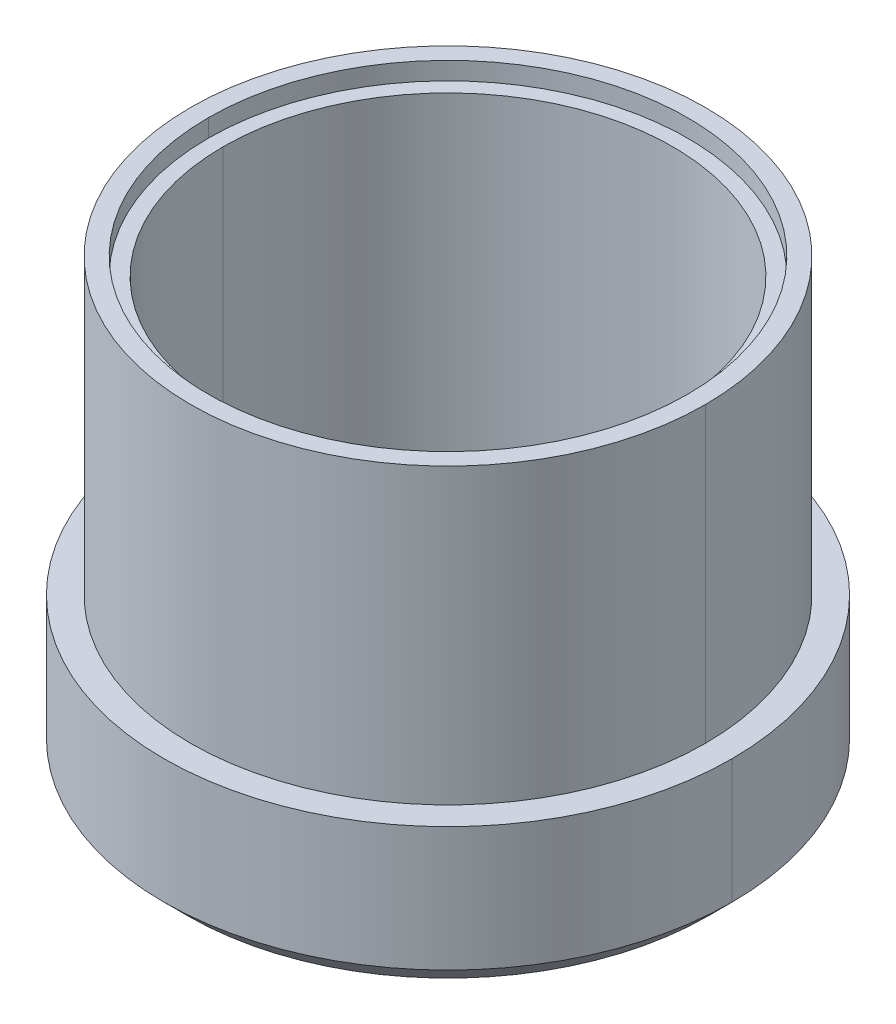
ISO-10303-21;
HEADER;
FILE_DESCRIPTION(('STEP AP214'),'2;1');
FILE_NAME('part.step','',(''),(''),'','','');
FILE_SCHEMA(('AUTOMOTIVE_DESIGN { 1 0 10303 214 1 1 1 1 }'));
ENDSEC;
DATA;
#1=APPLICATION_CONTEXT('core data for automotive mechanical design processes');
#2=APPLICATION_PROTOCOL_DEFINITION('international standard','automotive_design',2000,#1);
#3=PRODUCT_CONTEXT('',#1,'mechanical');
#4=PRODUCT('Part','Part','',(#3));
#5=PRODUCT_RELATED_PRODUCT_CATEGORY('part','',(#4));
#6=PRODUCT_DEFINITION_FORMATION('','',#4);
#7=PRODUCT_DEFINITION_CONTEXT('part definition',#1,'design');
#8=PRODUCT_DEFINITION('design','',#6,#7);
#9=PRODUCT_DEFINITION_SHAPE('','',#8);
#10=(LENGTH_UNIT() NAMED_UNIT(*) SI_UNIT(.MILLI.,.METRE.));
#11=(NAMED_UNIT(*) PLANE_ANGLE_UNIT() SI_UNIT($,.RADIAN.));
#12=(NAMED_UNIT(*) SI_UNIT($,.STERADIAN.) SOLID_ANGLE_UNIT());
#13=UNCERTAINTY_MEASURE_WITH_UNIT(LENGTH_MEASURE(1.E-05),#10,'distance_accuracy_value','');
#14=(GEOMETRIC_REPRESENTATION_CONTEXT(3) GLOBAL_UNCERTAINTY_ASSIGNED_CONTEXT((#13)) GLOBAL_UNIT_ASSIGNED_CONTEXT((#10,
#11,#12)) REPRESENTATION_CONTEXT('',''));
#15=CARTESIAN_POINT('',(0.,0.,0.));
#16=DIRECTION('',(0.,0.,1.));
#17=DIRECTION('',(1.,0.,0.));
#18=AXIS2_PLACEMENT_3D('',#15,#16,#17);
#19=CARTESIAN_POINT('',(0.,0.,0.));
#20=DIRECTION('',(0.,1.,0.));
#21=DIRECTION('',(0.,0.,1.));
#22=AXIS2_PLACEMENT_3D('',#19,#20,#21);
#23=CYLINDRICAL_SURFACE('',#22,5.5245);
#24=DIRECTION('',(0.,1.,0.));
#25=VECTOR('',#24,1.);
#26=CARTESIAN_POINT('',(-5.5245,0.,0.));
#27=LINE('',#26,#25);
#28=CARTESIAN_POINT('',(-5.5245,3.175,0.));
#29=VERTEX_POINT('',#28);
#30=CARTESIAN_POINT('',(-5.5245,9.4742,0.));
#31=VERTEX_POINT('',#30);
#32=EDGE_CURVE('E93',#29,#31,#27,.T.);
#33=ORIENTED_EDGE('',*,*,#32,.F.);
#34=CARTESIAN_POINT('',(0.,3.175,0.));
#35=DIRECTION('',(0.,1.,0.));
#36=DIRECTION('',(0.,0.,1.));
#37=AXIS2_PLACEMENT_3D('',#34,#35,#36);
#38=CIRCLE('',#37,5.5245);
#39=CARTESIAN_POINT('',(5.5245,3.175,0.));
#40=VERTEX_POINT('',#39);
#41=EDGE_CURVE('E19',#40,#29,#38,.F.);
#42=ORIENTED_EDGE('',*,*,#41,.F.);
#43=DIRECTION('',(0.,1.,0.));
#44=VECTOR('',#43,1.);
#45=CARTESIAN_POINT('',(5.5245,0.,0.));
#46=LINE('',#45,#44);
#47=CARTESIAN_POINT('',(5.5245,9.4742,0.));
#48=VERTEX_POINT('',#47);
#49=EDGE_CURVE('E82',#48,#40,#46,.F.);
#50=ORIENTED_EDGE('',*,*,#49,.F.);
#51=CARTESIAN_POINT('',(0.,9.4742,0.));
#52=DIRECTION('',(0.,1.,0.));
#53=DIRECTION('',(0.,0.,1.));
#54=AXIS2_PLACEMENT_3D('',#51,#52,#53);
#55=CIRCLE('',#54,5.5245);
#56=EDGE_CURVE('E94',#31,#48,#55,.T.);
#57=ORIENTED_EDGE('',*,*,#56,.F.);
#58=EDGE_LOOP('',(#33,#42,#50,#57));
#59=FACE_BOUND('',#58,.T.);
#60=ADVANCED_FACE('F16',(#59),#23,.T.);
#61=CARTESIAN_POINT('',(0.,0.,0.));
#62=DIRECTION('',(0.,1.,0.));
#63=DIRECTION('',(0.,0.,1.));
#64=AXIS2_PLACEMENT_3D('',#61,#62,#63);
#65=CYLINDRICAL_SURFACE('',#64,5.5245);
#66=ORIENTED_EDGE('',*,*,#49,.T.);
#67=CARTESIAN_POINT('',(0.,3.175,0.));
#68=DIRECTION('',(0.,1.,0.));
#69=DIRECTION('',(0.,0.,1.));
#70=AXIS2_PLACEMENT_3D('',#67,#68,#69);
#71=CIRCLE('',#70,5.5245);
#72=EDGE_CURVE('E90',#29,#40,#71,.F.);
#73=ORIENTED_EDGE('',*,*,#72,.F.);
#74=ORIENTED_EDGE('',*,*,#32,.T.);
#75=CARTESIAN_POINT('',(0.,9.4742,0.));
#76=DIRECTION('',(0.,1.,0.));
#77=DIRECTION('',(0.,0.,1.));
#78=AXIS2_PLACEMENT_3D('',#75,#76,#77);
#79=CIRCLE('',#78,5.5245);
#80=EDGE_CURVE('E98',#48,#31,#79,.T.);
#81=ORIENTED_EDGE('',*,*,#80,.F.);
#82=EDGE_LOOP('',(#66,#73,#74,#81));
#83=FACE_BOUND('',#82,.T.);
#84=ADVANCED_FACE('F97',(#83),#65,.T.);
#85=CARTESIAN_POINT('',(0.,3.175,0.));
#86=DIRECTION('',(0.,1.,0.));
#87=DIRECTION('',(0.,0.,1.));
#88=AXIS2_PLACEMENT_3D('',#85,#86,#87);
#89=PLANE('',#88);
#90=ORIENTED_EDGE('',*,*,#41,.T.);
#91=ORIENTED_EDGE('',*,*,#72,.T.);
#92=EDGE_LOOP('',(#90,#91));
#93=FACE_BOUND('',#92,.T.);
#94=CARTESIAN_POINT('',(0.,3.175,0.));
#95=DIRECTION('',(0.,1.,0.));
#96=DIRECTION('',(0.,0.,1.));
#97=AXIS2_PLACEMENT_3D('',#94,#95,#96);
#98=CIRCLE('',#97,6.096);
#99=CARTESIAN_POINT('',(6.096,3.175,0.));
#100=VERTEX_POINT('',#99);
#101=CARTESIAN_POINT('',(-6.096,3.175,0.));
#102=VERTEX_POINT('',#101);
#103=EDGE_CURVE('E105',#100,#102,#98,.F.);
#104=ORIENTED_EDGE('',*,*,#103,.F.);
#105=CARTESIAN_POINT('',(0.,3.175,0.));
#106=DIRECTION('',(0.,1.,0.));
#107=DIRECTION('',(0.,0.,1.));
#108=AXIS2_PLACEMENT_3D('',#105,#106,#107);
#109=CIRCLE('',#108,6.096);
#110=EDGE_CURVE('E102',#102,#100,#109,.F.);
#111=ORIENTED_EDGE('',*,*,#110,.F.);
#112=EDGE_LOOP('',(#104,#111));
#113=FACE_BOUND('',#112,.T.);
#114=ADVANCED_FACE('F88',(#93,#113),#89,.T.);
#115=CARTESIAN_POINT('',(0.,9.4742,0.));
#116=DIRECTION('',(0.,1.,0.));
#117=DIRECTION('',(0.,0.,1.));
#118=AXIS2_PLACEMENT_3D('',#115,#116,#117);
#119=PLANE('',#118);
#120=CARTESIAN_POINT('',(0.,9.4742,0.));
#121=DIRECTION('',(0.,1.,0.));
#122=DIRECTION('',(0.,0.,1.));
#123=AXIS2_PLACEMENT_3D('',#120,#121,#122);
#124=CIRCLE('',#123,5.1435);
#125=CARTESIAN_POINT('',(5.1435,9.4742,0.));
#126=VERTEX_POINT('',#125);
#127=CARTESIAN_POINT('',(-5.1435,9.4742,0.));
#128=VERTEX_POINT('',#127);
#129=EDGE_CURVE('E108',#126,#128,#124,.F.);
#130=ORIENTED_EDGE('',*,*,#129,.T.);
#131=CARTESIAN_POINT('',(0.,9.4742,0.));
#132=DIRECTION('',(0.,1.,0.));
#133=DIRECTION('',(0.,0.,1.));
#134=AXIS2_PLACEMENT_3D('',#131,#132,#133);
#135=CIRCLE('',#134,5.1435);
#136=EDGE_CURVE('E111',#128,#126,#135,.F.);
#137=ORIENTED_EDGE('',*,*,#136,.T.);
#138=EDGE_LOOP('',(#130,#137));
#139=FACE_BOUND('',#138,.T.);
#140=ORIENTED_EDGE('',*,*,#56,.T.);
#141=ORIENTED_EDGE('',*,*,#80,.T.);
#142=EDGE_LOOP('',(#140,#141));
#143=FACE_BOUND('',#142,.T.);
#144=ADVANCED_FACE('F188',(#139,#143),#119,.T.);
#145=CARTESIAN_POINT('',(0.,0.,0.));
#146=DIRECTION('',(0.,1.,0.));
#147=DIRECTION('',(0.,0.,1.));
#148=AXIS2_PLACEMENT_3D('',#145,#146,#147);
#149=CYLINDRICAL_SURFACE('',#148,6.096);
#150=DIRECTION('',(0.,1.,0.));
#151=VECTOR('',#150,1.);
#152=CARTESIAN_POINT('',(6.096,0.,0.));
#153=LINE('',#152,#151);
#154=CARTESIAN_POINT('',(6.09599999999602,0.508000000003506,0.));
#155=VERTEX_POINT('',#154);
#156=EDGE_CURVE('E104',#155,#100,#153,.T.);
#157=ORIENTED_EDGE('',*,*,#156,.F.);
#158=CARTESIAN_POINT('',(0.,0.508000000024822,0.));
#159=DIRECTION('',(0.,1.,0.));
#160=DIRECTION('',(1.,0.,0.));
#161=AXIS2_PLACEMENT_3D('',#158,#159,#160);
#162=CIRCLE('',#161,6.09600000001365);
#163=CARTESIAN_POINT('',(-6.09599999999602,0.508000000004405,0.));
#164=VERTEX_POINT('',#163);
#165=EDGE_CURVE('E146',#164,#155,#162,.F.);
#166=ORIENTED_EDGE('',*,*,#165,.F.);
#167=DIRECTION('',(0.,1.,0.));
#168=VECTOR('',#167,1.);
#169=CARTESIAN_POINT('',(-6.096,0.,0.));
#170=LINE('',#169,#168);
#171=EDGE_CURVE('E107',#102,#164,#170,.F.);
#172=ORIENTED_EDGE('',*,*,#171,.F.);
#173=ORIENTED_EDGE('',*,*,#110,.T.);
#174=EDGE_LOOP('',(#157,#166,#172,#173));
#175=FACE_BOUND('',#174,.T.);
#176=ADVANCED_FACE('F186',(#175),#149,.T.);
#177=CARTESIAN_POINT('',(0.,0.,0.));
#178=DIRECTION('',(0.,1.,0.));
#179=DIRECTION('',(0.,0.,1.));
#180=AXIS2_PLACEMENT_3D('',#177,#178,#179);
#181=CYLINDRICAL_SURFACE('',#180,6.096);
#182=ORIENTED_EDGE('',*,*,#171,.T.);
#183=CARTESIAN_POINT('',(0.,0.508000000024822,0.));
#184=DIRECTION('',(0.,1.,0.));
#185=DIRECTION('',(1.,0.,0.));
#186=AXIS2_PLACEMENT_3D('',#183,#184,#185);
#187=CIRCLE('',#186,6.09600000001365);
#188=EDGE_CURVE('E142',#155,#164,#187,.F.);
#189=ORIENTED_EDGE('',*,*,#188,.F.);
#190=ORIENTED_EDGE('',*,*,#156,.T.);
#191=ORIENTED_EDGE('',*,*,#103,.T.);
#192=EDGE_LOOP('',(#182,#189,#190,#191));
#193=FACE_BOUND('',#192,.T.);
#194=ADVANCED_FACE('F182',(#193),#181,.T.);
#195=CARTESIAN_POINT('',(0.,9.4742,0.));
#196=DIRECTION('',(0.,1.,0.));
#197=DIRECTION('',(0.,0.,1.));
#198=AXIS2_PLACEMENT_3D('',#195,#196,#197);
#199=CYLINDRICAL_SURFACE('',#198,5.1435);
#200=CARTESIAN_POINT('',(0.,9.0932,0.));
#201=DIRECTION('',(0.,1.,0.));
#202=DIRECTION('',(0.,0.,1.));
#203=AXIS2_PLACEMENT_3D('',#200,#201,#202);
#204=CIRCLE('',#203,5.1435);
#205=CARTESIAN_POINT('',(-5.1435,9.0932,0.));
#206=VERTEX_POINT('',#205);
#207=CARTESIAN_POINT('',(5.1435,9.0932,0.));
#208=VERTEX_POINT('',#207);
#209=EDGE_CURVE('E115',#206,#208,#204,.T.);
#210=ORIENTED_EDGE('',*,*,#209,.F.);
#211=DIRECTION('',(0.,1.,0.));
#212=VECTOR('',#211,1.);
#213=CARTESIAN_POINT('',(-5.1435,9.4742,0.));
#214=LINE('',#213,#212);
#215=EDGE_CURVE('E149',#206,#128,#214,.T.);
#216=ORIENTED_EDGE('',*,*,#215,.T.);
#217=ORIENTED_EDGE('',*,*,#129,.F.);
#218=DIRECTION('',(0.,1.,0.));
#219=VECTOR('',#218,1.);
#220=CARTESIAN_POINT('',(5.1435,9.4742,0.));
#221=LINE('',#220,#219);
#222=EDGE_CURVE('E114',#126,#208,#221,.F.);
#223=ORIENTED_EDGE('',*,*,#222,.T.);
#224=EDGE_LOOP('',(#210,#216,#217,#223));
#225=FACE_BOUND('',#224,.T.);
#226=ADVANCED_FACE('F213',(#225),#199,.F.);
#227=CARTESIAN_POINT('',(0.,9.4742,0.));
#228=DIRECTION('',(0.,1.,0.));
#229=DIRECTION('',(0.,0.,1.));
#230=AXIS2_PLACEMENT_3D('',#227,#228,#229);
#231=CYLINDRICAL_SURFACE('',#230,5.1435);
#232=CARTESIAN_POINT('',(0.,9.0932,0.));
#233=DIRECTION('',(0.,1.,0.));
#234=DIRECTION('',(0.,0.,1.));
#235=AXIS2_PLACEMENT_3D('',#232,#233,#234);
#236=CIRCLE('',#235,5.1435);
#237=EDGE_CURVE('E117',#208,#206,#236,.T.);
#238=ORIENTED_EDGE('',*,*,#237,.F.);
#239=ORIENTED_EDGE('',*,*,#222,.F.);
#240=ORIENTED_EDGE('',*,*,#136,.F.);
#241=ORIENTED_EDGE('',*,*,#215,.F.);
#242=EDGE_LOOP('',(#238,#239,#240,#241));
#243=FACE_BOUND('',#242,.T.);
#244=ADVANCED_FACE('F210',(#243),#231,.F.);
#245=CARTESIAN_POINT('',(0.,0.507999999967979,0.));
#246=DIRECTION('',(0.,1.,0.));
#247=DIRECTION('',(0.,0.,1.));
#248=AXIS2_PLACEMENT_3D('',#245,#246,#247);
#249=CONICAL_SURFACE('',#248,6.0959999999568,0.785398163397448);
#250=DIRECTION('',(-0.707106781186443,-0.707106781186652,0.));
#251=VECTOR('',#250,1.);
#252=CARTESIAN_POINT('',(499000.,498994.412000148,0.));
#253=LINE('',#252,#251);
#254=CARTESIAN_POINT('',(5.58799999998882,0.,0.));
#255=VERTEX_POINT('',#254);
#256=EDGE_CURVE('E145',#255,#155,#253,.F.);
#257=ORIENTED_EDGE('',*,*,#256,.F.);
#258=CARTESIAN_POINT('',(0.,0.,0.));
#259=DIRECTION('',(0.,1.,0.));
#260=DIRECTION('',(0.,0.,1.));
#261=AXIS2_PLACEMENT_3D('',#258,#259,#260);
#262=CIRCLE('',#261,5.58799999998882);
#263=CARTESIAN_POINT('',(-5.58799999998882,0.,0.));
#264=VERTEX_POINT('',#263);
#265=EDGE_CURVE('E121',#255,#264,#262,.T.);
#266=ORIENTED_EDGE('',*,*,#265,.T.);
#267=DIRECTION('',(0.707106781186443,-0.707106781186652,0.));
#268=VECTOR('',#267,1.);
#269=CARTESIAN_POINT('',(-499000.,498994.412000148,-6.11098752774529E-11));
#270=LINE('',#269,#268);
#271=EDGE_CURVE('E118',#164,#264,#270,.T.);
#272=ORIENTED_EDGE('',*,*,#271,.F.);
#273=ORIENTED_EDGE('',*,*,#165,.T.);
#274=EDGE_LOOP('',(#257,#266,#272,#273));
#275=FACE_BOUND('',#274,.T.);
#276=ADVANCED_FACE('F174',(#275),#249,.T.);
#277=CARTESIAN_POINT('',(0.,0.507999999967979,0.));
#278=DIRECTION('',(0.,1.,0.));
#279=DIRECTION('',(0.,0.,1.));
#280=AXIS2_PLACEMENT_3D('',#277,#278,#279);
#281=CONICAL_SURFACE('',#280,6.0959999999568,0.785398163397448);
#282=ORIENTED_EDGE('',*,*,#271,.T.);
#283=CARTESIAN_POINT('',(0.,0.,0.));
#284=DIRECTION('',(0.,1.,0.));
#285=DIRECTION('',(0.,0.,1.));
#286=AXIS2_PLACEMENT_3D('',#283,#284,#285);
#287=CIRCLE('',#286,5.58799999998882);
#288=EDGE_CURVE('E124',#264,#255,#287,.T.);
#289=ORIENTED_EDGE('',*,*,#288,.T.);
#290=ORIENTED_EDGE('',*,*,#256,.T.);
#291=ORIENTED_EDGE('',*,*,#188,.T.);
#292=EDGE_LOOP('',(#282,#289,#290,#291));
#293=FACE_BOUND('',#292,.T.);
#294=ADVANCED_FACE('F178',(#293),#281,.T.);
#295=CARTESIAN_POINT('',(0.,9.0932,0.));
#296=DIRECTION('',(0.,1.,0.));
#297=DIRECTION('',(0.,0.,1.));
#298=AXIS2_PLACEMENT_3D('',#295,#296,#297);
#299=PLANE('',#298);
#300=CARTESIAN_POINT('',(0.,9.0932,0.));
#301=DIRECTION('',(0.,1.,0.));
#302=DIRECTION('',(0.,0.,1.));
#303=AXIS2_PLACEMENT_3D('',#300,#301,#302);
#304=CIRCLE('',#303,4.826);
#305=CARTESIAN_POINT('',(-4.826,9.0932,0.));
#306=VERTEX_POINT('',#305);
#307=CARTESIAN_POINT('',(4.826,9.0932,0.));
#308=VERTEX_POINT('',#307);
#309=EDGE_CURVE('E127',#306,#308,#304,.F.);
#310=ORIENTED_EDGE('',*,*,#309,.T.);
#311=CARTESIAN_POINT('',(0.,9.0932,0.));
#312=DIRECTION('',(0.,1.,0.));
#313=DIRECTION('',(0.,0.,1.));
#314=AXIS2_PLACEMENT_3D('',#311,#312,#313);
#315=CIRCLE('',#314,4.826);
#316=EDGE_CURVE('E131',#308,#306,#315,.F.);
#317=ORIENTED_EDGE('',*,*,#316,.T.);
#318=EDGE_LOOP('',(#310,#317));
#319=FACE_BOUND('',#318,.T.);
#320=ORIENTED_EDGE('',*,*,#209,.T.);
#321=ORIENTED_EDGE('',*,*,#237,.T.);
#322=EDGE_LOOP('',(#320,#321));
#323=FACE_BOUND('',#322,.T.);
#324=ADVANCED_FACE('F163',(#319,#323),#299,.T.);
#325=CARTESIAN_POINT('',(0.,0.,0.));
#326=DIRECTION('',(0.,1.,0.));
#327=DIRECTION('',(0.,0.,1.));
#328=AXIS2_PLACEMENT_3D('',#325,#326,#327);
#329=PLANE('',#328);
#330=CARTESIAN_POINT('',(0.,0.,0.));
#331=DIRECTION('',(0.,1.,0.));
#332=DIRECTION('',(0.,0.,1.));
#333=AXIS2_PLACEMENT_3D('',#330,#331,#332);
#334=CIRCLE('',#333,4.826);
#335=CARTESIAN_POINT('',(-4.826,0.,0.));
#336=VERTEX_POINT('',#335);
#337=CARTESIAN_POINT('',(4.826,0.,0.));
#338=VERTEX_POINT('',#337);
#339=EDGE_CURVE('E25',#336,#338,#334,.T.);
#340=ORIENTED_EDGE('',*,*,#339,.T.);
#341=CARTESIAN_POINT('',(0.,0.,0.));
#342=DIRECTION('',(0.,1.,0.));
#343=DIRECTION('',(0.,0.,1.));
#344=AXIS2_PLACEMENT_3D('',#341,#342,#343);
#345=CIRCLE('',#344,4.826);
#346=EDGE_CURVE('E33',#338,#336,#345,.T.);
#347=ORIENTED_EDGE('',*,*,#346,.T.);
#348=EDGE_LOOP('',(#340,#347));
#349=FACE_BOUND('',#348,.T.);
#350=ORIENTED_EDGE('',*,*,#265,.F.);
#351=ORIENTED_EDGE('',*,*,#288,.F.);
#352=EDGE_LOOP('',(#350,#351));
#353=FACE_BOUND('',#352,.T.);
#354=ADVANCED_FACE('F166',(#349,#353),#329,.F.);
#355=CARTESIAN_POINT('',(0.,0.,0.));
#356=DIRECTION('',(0.,1.,0.));
#357=DIRECTION('',(0.,0.,1.));
#358=AXIS2_PLACEMENT_3D('',#355,#356,#357);
#359=CYLINDRICAL_SURFACE('',#358,4.826);
#360=ORIENTED_EDGE('',*,*,#346,.F.);
#361=DIRECTION('',(0.,1.,0.));
#362=VECTOR('',#361,1.);
#363=CARTESIAN_POINT('',(4.826,0.,0.));
#364=LINE('',#363,#362);
#365=EDGE_CURVE('E10',#338,#308,#364,.T.);
#366=ORIENTED_EDGE('',*,*,#365,.T.);
#367=ORIENTED_EDGE('',*,*,#309,.F.);
#368=DIRECTION('',(0.,1.,0.));
#369=VECTOR('',#368,1.);
#370=CARTESIAN_POINT('',(-4.826,0.,0.));
#371=LINE('',#370,#369);
#372=EDGE_CURVE('E134',#306,#336,#371,.F.);
#373=ORIENTED_EDGE('',*,*,#372,.T.);
#374=EDGE_LOOP('',(#360,#366,#367,#373));
#375=FACE_BOUND('',#374,.T.);
#376=ADVANCED_FACE('F158',(#375),#359,.F.);
#377=CARTESIAN_POINT('',(0.,0.,0.));
#378=DIRECTION('',(0.,1.,0.));
#379=DIRECTION('',(0.,0.,1.));
#380=AXIS2_PLACEMENT_3D('',#377,#378,#379);
#381=CYLINDRICAL_SURFACE('',#380,4.826);
#382=ORIENTED_EDGE('',*,*,#339,.F.);
#383=ORIENTED_EDGE('',*,*,#372,.F.);
#384=ORIENTED_EDGE('',*,*,#316,.F.);
#385=ORIENTED_EDGE('',*,*,#365,.F.);
#386=EDGE_LOOP('',(#382,#383,#384,#385));
#387=FACE_BOUND('',#386,.T.);
#388=ADVANCED_FACE('F161',(#387),#381,.F.);
#389=CLOSED_SHELL('',(#60,#84,#114,#144,#176,#194,#226,#244,#276,#294,#324,#354,#376,#388));
#390=MANIFOLD_SOLID_BREP('B1',#389);
#391=ADVANCED_BREP_SHAPE_REPRESENTATION('',(#18,#390),#14);
#392=SHAPE_DEFINITION_REPRESENTATION(#9,#391);
ENDSEC;
END-ISO-10303-21;
